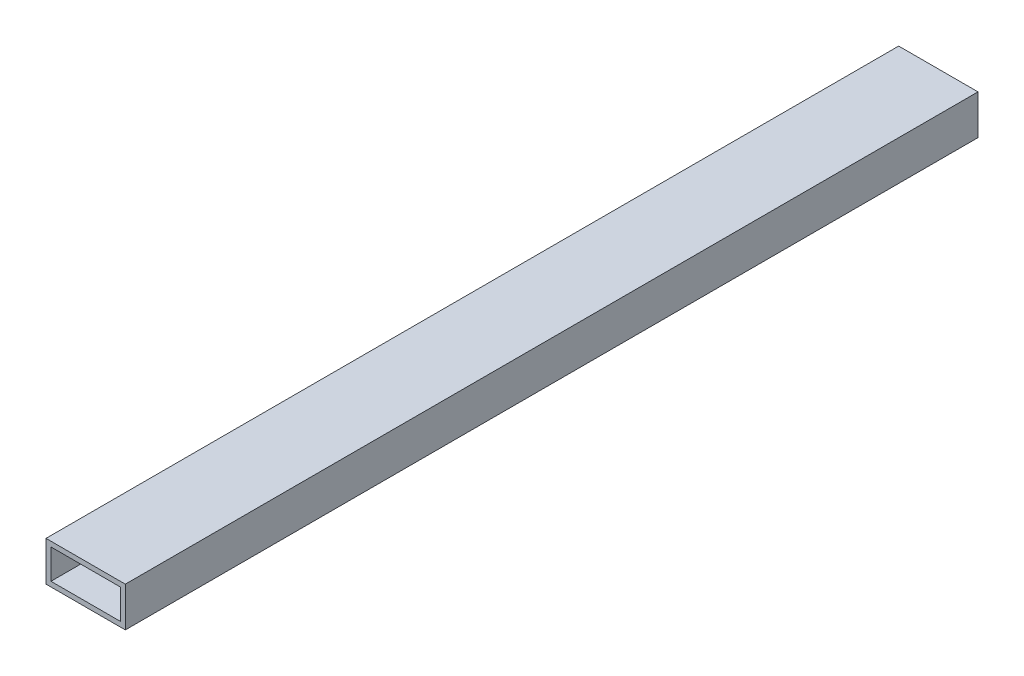
ISO-10303-21;
HEADER;
FILE_DESCRIPTION(('STEP AP214'),'2;1');
FILE_NAME('part.step','',(''),(''),'','','');
FILE_SCHEMA(('AUTOMOTIVE_DESIGN { 1 0 10303 214 1 1 1 1 }'));
ENDSEC;
DATA;
#1=APPLICATION_CONTEXT('core data for automotive mechanical design processes');
#2=APPLICATION_PROTOCOL_DEFINITION('international standard','automotive_design',2000,#1);
#3=PRODUCT_CONTEXT('',#1,'mechanical');
#4=PRODUCT('Part','Part','',(#3));
#5=PRODUCT_RELATED_PRODUCT_CATEGORY('part','',(#4));
#6=PRODUCT_DEFINITION_FORMATION('','',#4);
#7=PRODUCT_DEFINITION_CONTEXT('part definition',#1,'design');
#8=PRODUCT_DEFINITION('design','',#6,#7);
#9=PRODUCT_DEFINITION_SHAPE('','',#8);
#10=(LENGTH_UNIT() NAMED_UNIT(*) SI_UNIT(.MILLI.,.METRE.));
#11=(NAMED_UNIT(*) PLANE_ANGLE_UNIT() SI_UNIT($,.RADIAN.));
#12=(NAMED_UNIT(*) SI_UNIT($,.STERADIAN.) SOLID_ANGLE_UNIT());
#13=UNCERTAINTY_MEASURE_WITH_UNIT(LENGTH_MEASURE(1.E-05),#10,'distance_accuracy_value','');
#14=(GEOMETRIC_REPRESENTATION_CONTEXT(3) GLOBAL_UNCERTAINTY_ASSIGNED_CONTEXT((#13)) GLOBAL_UNIT_ASSIGNED_CONTEXT((#10,
#11,#12)) REPRESENTATION_CONTEXT('',''));
#15=CARTESIAN_POINT('',(0.,0.,0.));
#16=DIRECTION('',(0.,0.,1.));
#17=DIRECTION('',(1.,0.,0.));
#18=AXIS2_PLACEMENT_3D('',#15,#16,#17);
#19=CARTESIAN_POINT('',(0.,0.,546.1));
#20=DIRECTION('',(0.,0.,-1.));
#21=DIRECTION('',(-1.,0.,0.));
#22=AXIS2_PLACEMENT_3D('',#19,#20,#21);
#23=PLANE('',#22);
#24=DIRECTION('',(0.,-1.,0.));
#25=VECTOR('',#24,1.);
#26=CARTESIAN_POINT('',(0.,0.,546.1));
#27=LINE('',#26,#25);
#28=CARTESIAN_POINT('',(0.,25.4,546.1));
#29=VERTEX_POINT('',#28);
#30=CARTESIAN_POINT('',(0.,0.,546.1));
#31=VERTEX_POINT('',#30);
#32=EDGE_CURVE('E141',#29,#31,#27,.T.);
#33=ORIENTED_EDGE('',*,*,#32,.T.);
#34=DIRECTION('',(1.,0.,0.));
#35=VECTOR('',#34,1.);
#36=CARTESIAN_POINT('',(0.,0.,546.1));
#37=LINE('',#36,#35);
#38=CARTESIAN_POINT('',(50.8,0.,546.1));
#39=VERTEX_POINT('',#38);
#40=EDGE_CURVE('E144',#31,#39,#37,.T.);
#41=ORIENTED_EDGE('',*,*,#40,.T.);
#42=DIRECTION('',(0.,1.,0.));
#43=VECTOR('',#42,1.);
#44=CARTESIAN_POINT('',(50.8,0.,546.1));
#45=LINE('',#44,#43);
#46=CARTESIAN_POINT('',(50.8,25.4,546.1));
#47=VERTEX_POINT('',#46);
#48=EDGE_CURVE('E147',#39,#47,#45,.T.);
#49=ORIENTED_EDGE('',*,*,#48,.T.);
#50=DIRECTION('',(-1.,0.,0.));
#51=VECTOR('',#50,1.);
#52=CARTESIAN_POINT('',(0.,25.4,546.1));
#53=LINE('',#52,#51);
#54=EDGE_CURVE('E149',#47,#29,#53,.T.);
#55=ORIENTED_EDGE('',*,*,#54,.T.);
#56=EDGE_LOOP('',(#33,#41,#49,#55));
#57=FACE_BOUND('',#56,.T.);
#58=DIRECTION('',(0.,-1.,0.));
#59=VECTOR('',#58,1.);
#60=CARTESIAN_POINT('',(3.175,3.175,546.1));
#61=LINE('',#60,#59);
#62=CARTESIAN_POINT('',(3.175,22.225,546.1));
#63=VERTEX_POINT('',#62);
#64=CARTESIAN_POINT('',(3.175,3.175,546.1));
#65=VERTEX_POINT('',#64);
#66=EDGE_CURVE('E105',#63,#65,#61,.T.);
#67=ORIENTED_EDGE('',*,*,#66,.F.);
#68=DIRECTION('',(-1.,0.,0.));
#69=VECTOR('',#68,1.);
#70=CARTESIAN_POINT('',(3.175,22.225,546.1));
#71=LINE('',#70,#69);
#72=CARTESIAN_POINT('',(47.625,22.225,546.1));
#73=VERTEX_POINT('',#72);
#74=EDGE_CURVE('E127',#73,#63,#71,.T.);
#75=ORIENTED_EDGE('',*,*,#74,.F.);
#76=DIRECTION('',(0.,1.,0.));
#77=VECTOR('',#76,1.);
#78=CARTESIAN_POINT('',(47.625,3.175,546.1));
#79=LINE('',#78,#77);
#80=CARTESIAN_POINT('',(47.625,3.175,546.1));
#81=VERTEX_POINT('',#80);
#82=EDGE_CURVE('E125',#81,#73,#79,.T.);
#83=ORIENTED_EDGE('',*,*,#82,.F.);
#84=DIRECTION('',(1.,0.,0.));
#85=VECTOR('',#84,1.);
#86=CARTESIAN_POINT('',(3.175,3.175,546.1));
#87=LINE('',#86,#85);
#88=EDGE_CURVE('E113',#65,#81,#87,.T.);
#89=ORIENTED_EDGE('',*,*,#88,.F.);
#90=EDGE_LOOP('',(#67,#75,#83,#89));
#91=FACE_BOUND('',#90,.T.);
#92=ADVANCED_FACE('F40',(#57,#91),#23,.F.);
#93=CARTESIAN_POINT('',(0.,0.,0.));
#94=DIRECTION('',(0.,0.,-1.));
#95=DIRECTION('',(-1.,0.,0.));
#96=AXIS2_PLACEMENT_3D('',#93,#94,#95);
#97=PLANE('',#96);
#98=DIRECTION('',(0.,-1.,0.));
#99=VECTOR('',#98,1.);
#100=CARTESIAN_POINT('',(0.,0.,0.));
#101=LINE('',#100,#99);
#102=CARTESIAN_POINT('',(0.,25.4,0.));
#103=VERTEX_POINT('',#102);
#104=CARTESIAN_POINT('',(0.,0.,0.));
#105=VERTEX_POINT('',#104);
#106=EDGE_CURVE('E121',#103,#105,#101,.T.);
#107=ORIENTED_EDGE('',*,*,#106,.F.);
#108=DIRECTION('',(-1.,0.,0.));
#109=VECTOR('',#108,1.);
#110=CARTESIAN_POINT('',(0.,25.4,0.));
#111=LINE('',#110,#109);
#112=CARTESIAN_POINT('',(50.8,25.4,0.));
#113=VERTEX_POINT('',#112);
#114=EDGE_CURVE('E145',#113,#103,#111,.T.);
#115=ORIENTED_EDGE('',*,*,#114,.F.);
#116=DIRECTION('',(0.,1.,0.));
#117=VECTOR('',#116,1.);
#118=CARTESIAN_POINT('',(50.8,0.,0.));
#119=LINE('',#118,#117);
#120=CARTESIAN_POINT('',(50.8,0.,0.));
#121=VERTEX_POINT('',#120);
#122=EDGE_CURVE('E156',#121,#113,#119,.T.);
#123=ORIENTED_EDGE('',*,*,#122,.F.);
#124=DIRECTION('',(1.,0.,0.));
#125=VECTOR('',#124,1.);
#126=CARTESIAN_POINT('',(0.,0.,0.));
#127=LINE('',#126,#125);
#128=EDGE_CURVE('E154',#105,#121,#127,.T.);
#129=ORIENTED_EDGE('',*,*,#128,.F.);
#130=EDGE_LOOP('',(#107,#115,#123,#129));
#131=FACE_BOUND('',#130,.T.);
#132=DIRECTION('',(-1.,0.,0.));
#133=VECTOR('',#132,1.);
#134=CARTESIAN_POINT('',(3.175,22.225,0.));
#135=LINE('',#134,#133);
#136=CARTESIAN_POINT('',(47.625,22.225,0.));
#137=VERTEX_POINT('',#136);
#138=CARTESIAN_POINT('',(3.175,22.225,0.));
#139=VERTEX_POINT('',#138);
#140=EDGE_CURVE('E114',#137,#139,#135,.T.);
#141=ORIENTED_EDGE('',*,*,#140,.T.);
#142=DIRECTION('',(0.,-1.,0.));
#143=VECTOR('',#142,1.);
#144=CARTESIAN_POINT('',(3.175,3.175,0.));
#145=LINE('',#144,#143);
#146=CARTESIAN_POINT('',(3.175,3.175,0.));
#147=VERTEX_POINT('',#146);
#148=EDGE_CURVE('E63',#139,#147,#145,.T.);
#149=ORIENTED_EDGE('',*,*,#148,.T.);
#150=DIRECTION('',(1.,0.,0.));
#151=VECTOR('',#150,1.);
#152=CARTESIAN_POINT('',(3.175,3.175,0.));
#153=LINE('',#152,#151);
#154=CARTESIAN_POINT('',(47.625,3.175,0.));
#155=VERTEX_POINT('',#154);
#156=EDGE_CURVE('E120',#147,#155,#153,.T.);
#157=ORIENTED_EDGE('',*,*,#156,.T.);
#158=DIRECTION('',(0.,1.,0.));
#159=VECTOR('',#158,1.);
#160=CARTESIAN_POINT('',(47.625,3.175,0.));
#161=LINE('',#160,#159);
#162=EDGE_CURVE('E133',#155,#137,#161,.T.);
#163=ORIENTED_EDGE('',*,*,#162,.T.);
#164=EDGE_LOOP('',(#141,#149,#157,#163));
#165=FACE_BOUND('',#164,.T.);
#166=ADVANCED_FACE('F174',(#131,#165),#97,.T.);
#167=CARTESIAN_POINT('',(0.,0.,546.1));
#168=DIRECTION('',(1.,0.,0.));
#169=DIRECTION('',(0.,0.,-1.));
#170=AXIS2_PLACEMENT_3D('',#167,#168,#169);
#171=PLANE('',#170);
#172=ORIENTED_EDGE('',*,*,#106,.T.);
#173=DIRECTION('',(0.,0.,-1.));
#174=VECTOR('',#173,1.);
#175=CARTESIAN_POINT('',(0.,0.,546.1));
#176=LINE('',#175,#174);
#177=EDGE_CURVE('E11',#31,#105,#176,.T.);
#178=ORIENTED_EDGE('',*,*,#177,.F.);
#179=ORIENTED_EDGE('',*,*,#32,.F.);
#180=DIRECTION('',(0.,0.,-1.));
#181=VECTOR('',#180,1.);
#182=CARTESIAN_POINT('',(0.,25.4,546.1));
#183=LINE('',#182,#181);
#184=EDGE_CURVE('E151',#29,#103,#183,.T.);
#185=ORIENTED_EDGE('',*,*,#184,.T.);
#186=EDGE_LOOP('',(#172,#178,#179,#185));
#187=FACE_BOUND('',#186,.T.);
#188=ADVANCED_FACE('F42',(#187),#171,.F.);
#189=CARTESIAN_POINT('',(0.,0.,546.1));
#190=DIRECTION('',(0.,1.,0.));
#191=DIRECTION('',(0.,0.,1.));
#192=AXIS2_PLACEMENT_3D('',#189,#190,#191);
#193=PLANE('',#192);
#194=ORIENTED_EDGE('',*,*,#128,.T.);
#195=DIRECTION('',(0.,0.,-1.));
#196=VECTOR('',#195,1.);
#197=CARTESIAN_POINT('',(50.8,0.,546.1));
#198=LINE('',#197,#196);
#199=EDGE_CURVE('E48',#39,#121,#198,.T.);
#200=ORIENTED_EDGE('',*,*,#199,.F.);
#201=ORIENTED_EDGE('',*,*,#40,.F.);
#202=ORIENTED_EDGE('',*,*,#177,.T.);
#203=EDGE_LOOP('',(#194,#200,#201,#202));
#204=FACE_BOUND('',#203,.T.);
#205=ADVANCED_FACE('F184',(#204),#193,.F.);
#206=CARTESIAN_POINT('',(50.8,0.,546.1));
#207=DIRECTION('',(-1.,0.,0.));
#208=DIRECTION('',(0.,0.,1.));
#209=AXIS2_PLACEMENT_3D('',#206,#207,#208);
#210=PLANE('',#209);
#211=ORIENTED_EDGE('',*,*,#122,.T.);
#212=DIRECTION('',(0.,0.,-1.));
#213=VECTOR('',#212,1.);
#214=CARTESIAN_POINT('',(50.8,25.4,546.1));
#215=LINE('',#214,#213);
#216=EDGE_CURVE('E161',#47,#113,#215,.T.);
#217=ORIENTED_EDGE('',*,*,#216,.F.);
#218=ORIENTED_EDGE('',*,*,#48,.F.);
#219=ORIENTED_EDGE('',*,*,#199,.T.);
#220=EDGE_LOOP('',(#211,#217,#218,#219));
#221=FACE_BOUND('',#220,.T.);
#222=ADVANCED_FACE('F168',(#221),#210,.F.);
#223=CARTESIAN_POINT('',(0.,25.4,546.1));
#224=DIRECTION('',(0.,-1.,0.));
#225=DIRECTION('',(0.,0.,-1.));
#226=AXIS2_PLACEMENT_3D('',#223,#224,#225);
#227=PLANE('',#226);
#228=ORIENTED_EDGE('',*,*,#114,.T.);
#229=ORIENTED_EDGE('',*,*,#184,.F.);
#230=ORIENTED_EDGE('',*,*,#54,.F.);
#231=ORIENTED_EDGE('',*,*,#216,.T.);
#232=EDGE_LOOP('',(#228,#229,#230,#231));
#233=FACE_BOUND('',#232,.T.);
#234=ADVANCED_FACE('F178',(#233),#227,.F.);
#235=CARTESIAN_POINT('',(3.175,3.175,546.1));
#236=DIRECTION('',(1.,0.,0.));
#237=DIRECTION('',(0.,0.,-1.));
#238=AXIS2_PLACEMENT_3D('',#235,#236,#237);
#239=PLANE('',#238);
#240=ORIENTED_EDGE('',*,*,#148,.F.);
#241=DIRECTION('',(0.,0.,-1.));
#242=VECTOR('',#241,1.);
#243=CARTESIAN_POINT('',(3.175,22.225,546.1));
#244=LINE('',#243,#242);
#245=EDGE_CURVE('E109',#63,#139,#244,.T.);
#246=ORIENTED_EDGE('',*,*,#245,.F.);
#247=ORIENTED_EDGE('',*,*,#66,.T.);
#248=DIRECTION('',(0.,0.,-1.));
#249=VECTOR('',#248,1.);
#250=CARTESIAN_POINT('',(3.175,3.175,546.1));
#251=LINE('',#250,#249);
#252=EDGE_CURVE('E108',#65,#147,#251,.T.);
#253=ORIENTED_EDGE('',*,*,#252,.T.);
#254=EDGE_LOOP('',(#240,#246,#247,#253));
#255=FACE_BOUND('',#254,.T.);
#256=ADVANCED_FACE('F107',(#255),#239,.T.);
#257=CARTESIAN_POINT('',(3.175,3.175,546.1));
#258=DIRECTION('',(0.,1.,0.));
#259=DIRECTION('',(0.,0.,1.));
#260=AXIS2_PLACEMENT_3D('',#257,#258,#259);
#261=PLANE('',#260);
#262=ORIENTED_EDGE('',*,*,#156,.F.);
#263=ORIENTED_EDGE('',*,*,#252,.F.);
#264=ORIENTED_EDGE('',*,*,#88,.T.);
#265=DIRECTION('',(0.,0.,-1.));
#266=VECTOR('',#265,1.);
#267=CARTESIAN_POINT('',(47.625,3.175,546.1));
#268=LINE('',#267,#266);
#269=EDGE_CURVE('E122',#81,#155,#268,.T.);
#270=ORIENTED_EDGE('',*,*,#269,.T.);
#271=EDGE_LOOP('',(#262,#263,#264,#270));
#272=FACE_BOUND('',#271,.T.);
#273=ADVANCED_FACE('F117',(#272),#261,.T.);
#274=CARTESIAN_POINT('',(47.625,3.175,546.1));
#275=DIRECTION('',(-1.,0.,0.));
#276=DIRECTION('',(0.,0.,1.));
#277=AXIS2_PLACEMENT_3D('',#274,#275,#276);
#278=PLANE('',#277);
#279=ORIENTED_EDGE('',*,*,#162,.F.);
#280=ORIENTED_EDGE('',*,*,#269,.F.);
#281=ORIENTED_EDGE('',*,*,#82,.T.);
#282=DIRECTION('',(0.,0.,-1.));
#283=VECTOR('',#282,1.);
#284=CARTESIAN_POINT('',(47.625,22.225,546.1));
#285=LINE('',#284,#283);
#286=EDGE_CURVE('E55',#73,#137,#285,.T.);
#287=ORIENTED_EDGE('',*,*,#286,.T.);
#288=EDGE_LOOP('',(#279,#280,#281,#287));
#289=FACE_BOUND('',#288,.T.);
#290=ADVANCED_FACE('F207',(#289),#278,.T.);
#291=CARTESIAN_POINT('',(3.175,22.225,546.1));
#292=DIRECTION('',(0.,-1.,0.));
#293=DIRECTION('',(0.,0.,-1.));
#294=AXIS2_PLACEMENT_3D('',#291,#292,#293);
#295=PLANE('',#294);
#296=ORIENTED_EDGE('',*,*,#140,.F.);
#297=ORIENTED_EDGE('',*,*,#286,.F.);
#298=ORIENTED_EDGE('',*,*,#74,.T.);
#299=ORIENTED_EDGE('',*,*,#245,.T.);
#300=EDGE_LOOP('',(#296,#297,#298,#299));
#301=FACE_BOUND('',#300,.T.);
#302=ADVANCED_FACE('F211',(#301),#295,.T.);
#303=CLOSED_SHELL('',(#92,#166,#188,#205,#222,#234,#256,#273,#290,#302));
#304=MANIFOLD_SOLID_BREP('B2',#303);
#305=ADVANCED_BREP_SHAPE_REPRESENTATION('',(#18,#304),#14);
#306=SHAPE_DEFINITION_REPRESENTATION(#9,#305);
ENDSEC;
END-ISO-10303-21;
